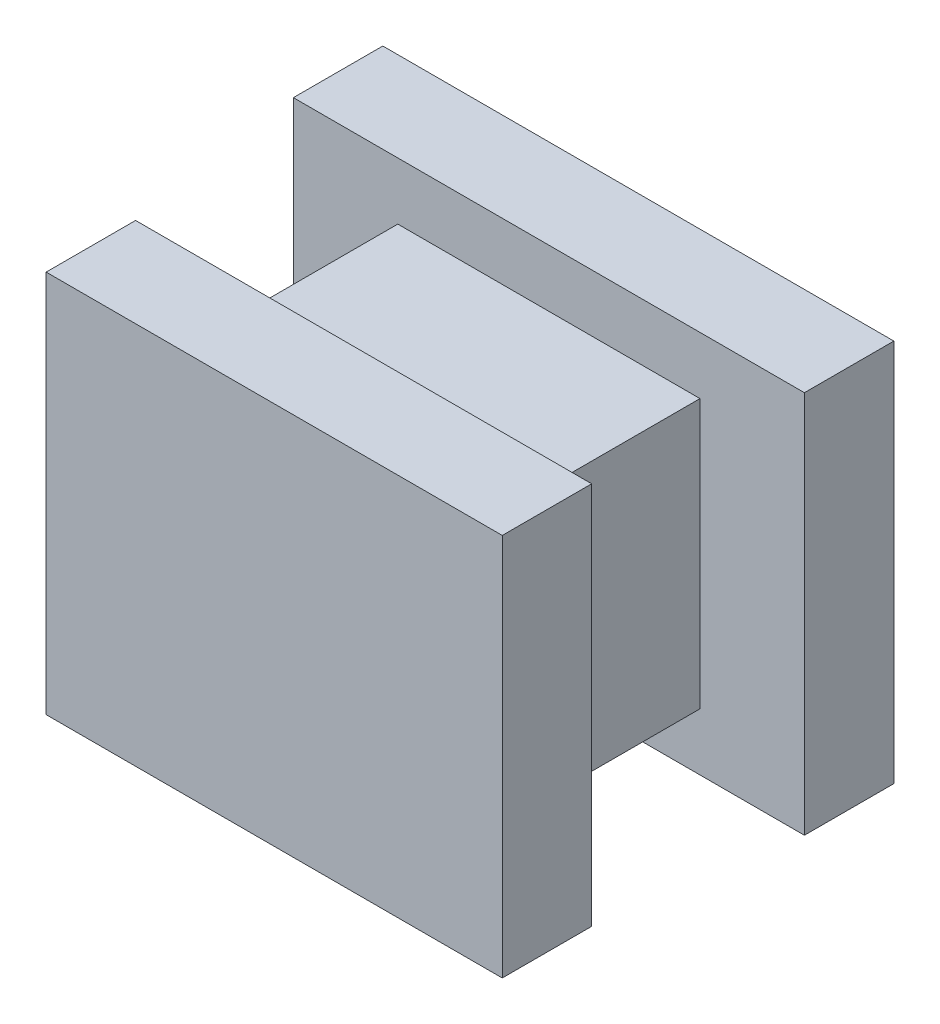
ISO-10303-21;
HEADER;
FILE_DESCRIPTION(('STEP AP214'),'2;1');
FILE_NAME('part.step','',(''),(''),'','','');
FILE_SCHEMA(('AUTOMOTIVE_DESIGN { 1 0 10303 214 1 1 1 1 }'));
ENDSEC;
DATA;
#1=APPLICATION_CONTEXT('core data for automotive mechanical design processes');
#2=APPLICATION_PROTOCOL_DEFINITION('international standard','automotive_design',2000,#1);
#3=PRODUCT_CONTEXT('',#1,'mechanical');
#4=PRODUCT('Part','Part','',(#3));
#5=PRODUCT_RELATED_PRODUCT_CATEGORY('part','',(#4));
#6=PRODUCT_DEFINITION_FORMATION('','',#4);
#7=PRODUCT_DEFINITION_CONTEXT('part definition',#1,'design');
#8=PRODUCT_DEFINITION('design','',#6,#7);
#9=PRODUCT_DEFINITION_SHAPE('','',#8);
#10=(LENGTH_UNIT() NAMED_UNIT(*) SI_UNIT(.MILLI.,.METRE.));
#11=(NAMED_UNIT(*) PLANE_ANGLE_UNIT() SI_UNIT($,.RADIAN.));
#12=(NAMED_UNIT(*) SI_UNIT($,.STERADIAN.) SOLID_ANGLE_UNIT());
#13=UNCERTAINTY_MEASURE_WITH_UNIT(LENGTH_MEASURE(1.E-05),#10,'distance_accuracy_value','');
#14=(GEOMETRIC_REPRESENTATION_CONTEXT(3) GLOBAL_UNCERTAINTY_ASSIGNED_CONTEXT((#13)) GLOBAL_UNIT_ASSIGNED_CONTEXT((#10,
#11,#12)) REPRESENTATION_CONTEXT('',''));
#15=CARTESIAN_POINT('',(0.,0.,0.));
#16=DIRECTION('',(0.,0.,1.));
#17=DIRECTION('',(1.,0.,0.));
#18=AXIS2_PLACEMENT_3D('',#15,#16,#17);
#19=CARTESIAN_POINT('',(0.,0.,2.15));
#20=DIRECTION('',(0.,0.,-1.));
#21=DIRECTION('',(-1.,0.,0.));
#22=AXIS2_PLACEMENT_3D('',#19,#20,#21);
#23=PLANE('',#22);
#24=DIRECTION('',(1.,0.,0.));
#25=VECTOR('',#24,1.);
#26=CARTESIAN_POINT('',(-0.982734697956289,-0.851456943735229,2.15));
#27=LINE('',#26,#25);
#28=CARTESIAN_POINT('',(-0.982734697956289,-0.851456943735229,2.15));
#29=VERTEX_POINT('',#28);
#30=CARTESIAN_POINT('',(0.982734697956289,-0.851456943735229,2.15));
#31=VERTEX_POINT('',#30);
#32=EDGE_CURVE('E135',#29,#31,#27,.T.);
#33=ORIENTED_EDGE('',*,*,#32,.F.);
#34=DIRECTION('',(0.,-1.,0.));
#35=VECTOR('',#34,1.);
#36=CARTESIAN_POINT('',(-0.982734697956289,0.851456943735229,2.15));
#37=LINE('',#36,#35);
#38=CARTESIAN_POINT('',(-0.982734697956289,0.851456943735229,2.15));
#39=VERTEX_POINT('',#38);
#40=EDGE_CURVE('E119',#39,#29,#37,.T.);
#41=ORIENTED_EDGE('',*,*,#40,.F.);
#42=DIRECTION('',(-1.,0.,0.));
#43=VECTOR('',#42,1.);
#44=CARTESIAN_POINT('',(-0.982734697956289,0.851456943735229,2.15));
#45=LINE('',#44,#43);
#46=CARTESIAN_POINT('',(0.982734697956289,0.851456943735229,2.15));
#47=VERTEX_POINT('',#46);
#48=EDGE_CURVE('E112',#47,#39,#45,.T.);
#49=ORIENTED_EDGE('',*,*,#48,.F.);
#50=DIRECTION('',(0.,1.,0.));
#51=VECTOR('',#50,1.);
#52=CARTESIAN_POINT('',(0.982734697956289,0.851456943735229,2.15));
#53=LINE('',#52,#51);
#54=EDGE_CURVE('E117',#31,#47,#53,.T.);
#55=ORIENTED_EDGE('',*,*,#54,.F.);
#56=EDGE_LOOP('',(#33,#41,#49,#55));
#57=FACE_BOUND('',#56,.T.);
#58=DIRECTION('',(1.,0.,0.));
#59=VECTOR('',#58,1.);
#60=CARTESIAN_POINT('',(-1.18273469795629,1.05145694373523,2.15));
#61=LINE('',#60,#59);
#62=CARTESIAN_POINT('',(-1.18273469795629,1.05145694373523,2.15));
#63=VERTEX_POINT('',#62);
#64=CARTESIAN_POINT('',(1.18273469795629,1.05145694373523,2.15));
#65=VERTEX_POINT('',#64);
#66=EDGE_CURVE('E167',#63,#65,#61,.T.);
#67=ORIENTED_EDGE('',*,*,#66,.F.);
#68=DIRECTION('',(0.,1.,0.));
#69=VECTOR('',#68,1.);
#70=CARTESIAN_POINT('',(-1.18273469795629,-1.05145694373523,2.15));
#71=LINE('',#70,#69);
#72=CARTESIAN_POINT('',(-1.18273469795629,-1.05145694373523,2.15));
#73=VERTEX_POINT('',#72);
#74=EDGE_CURVE('E159',#73,#63,#71,.T.);
#75=ORIENTED_EDGE('',*,*,#74,.F.);
#76=DIRECTION('',(-1.,0.,0.));
#77=VECTOR('',#76,1.);
#78=CARTESIAN_POINT('',(-1.18273469795629,-1.05145694373523,2.15));
#79=LINE('',#78,#77);
#80=CARTESIAN_POINT('',(1.18273469795629,-1.05145694373523,2.15));
#81=VERTEX_POINT('',#80);
#82=EDGE_CURVE('E156',#81,#73,#79,.T.);
#83=ORIENTED_EDGE('',*,*,#82,.F.);
#84=DIRECTION('',(0.,-1.,0.));
#85=VECTOR('',#84,1.);
#86=CARTESIAN_POINT('',(1.18273469795629,-1.05145694373523,2.15));
#87=LINE('',#86,#85);
#88=EDGE_CURVE('E123',#65,#81,#87,.T.);
#89=ORIENTED_EDGE('',*,*,#88,.F.);
#90=EDGE_LOOP('',(#67,#75,#83,#89));
#91=FACE_BOUND('',#90,.T.);
#92=ADVANCED_FACE('F43',(#57,#91),#23,.F.);
#93=CARTESIAN_POINT('',(-0.982734697956289,0.851456943735229,2.15));
#94=DIRECTION('',(0.,-1.,0.));
#95=DIRECTION('',(0.,0.,-1.));
#96=AXIS2_PLACEMENT_3D('',#93,#94,#95);
#97=PLANE('',#96);
#98=DIRECTION('',(-1.,0.,0.));
#99=VECTOR('',#98,1.);
#100=CARTESIAN_POINT('',(-0.982734697956289,0.851456943735229,0.7));
#101=LINE('',#100,#99);
#102=CARTESIAN_POINT('',(0.982734697956289,0.851456943735229,0.7));
#103=VERTEX_POINT('',#102);
#104=CARTESIAN_POINT('',(-0.982734697956289,0.851456943735229,0.7));
#105=VERTEX_POINT('',#104);
#106=EDGE_CURVE('E128',#103,#105,#101,.T.);
#107=ORIENTED_EDGE('',*,*,#106,.F.);
#108=DIRECTION('',(0.,0.,-1.));
#109=VECTOR('',#108,1.);
#110=CARTESIAN_POINT('',(0.982734697956289,0.851456943735229,2.15));
#111=LINE('',#110,#109);
#112=EDGE_CURVE('E47',#47,#103,#111,.T.);
#113=ORIENTED_EDGE('',*,*,#112,.F.);
#114=ORIENTED_EDGE('',*,*,#48,.T.);
#115=DIRECTION('',(0.,0.,-1.));
#116=VECTOR('',#115,1.);
#117=CARTESIAN_POINT('',(-0.982734697956289,0.851456943735229,2.15));
#118=LINE('',#117,#116);
#119=EDGE_CURVE('E124',#39,#105,#118,.T.);
#120=ORIENTED_EDGE('',*,*,#119,.T.);
#121=EDGE_LOOP('',(#107,#113,#114,#120));
#122=FACE_BOUND('',#121,.T.);
#123=ADVANCED_FACE('F127',(#122),#97,.T.);
#124=CARTESIAN_POINT('',(-0.982734697956289,0.851456943735229,2.15));
#125=DIRECTION('',(1.,0.,0.));
#126=DIRECTION('',(0.,0.,-1.));
#127=AXIS2_PLACEMENT_3D('',#124,#125,#126);
#128=PLANE('',#127);
#129=DIRECTION('',(0.,-1.,0.));
#130=VECTOR('',#129,1.);
#131=CARTESIAN_POINT('',(-0.982734697956289,0.851456943735229,0.7));
#132=LINE('',#131,#130);
#133=CARTESIAN_POINT('',(-0.982734697956289,-0.851456943735229,0.7));
#134=VERTEX_POINT('',#133);
#135=EDGE_CURVE('E163',#105,#134,#132,.T.);
#136=ORIENTED_EDGE('',*,*,#135,.F.);
#137=ORIENTED_EDGE('',*,*,#119,.F.);
#138=ORIENTED_EDGE('',*,*,#40,.T.);
#139=DIRECTION('',(0.,0.,-1.));
#140=VECTOR('',#139,1.);
#141=CARTESIAN_POINT('',(-0.982734697956289,-0.851456943735229,2.15));
#142=LINE('',#141,#140);
#143=EDGE_CURVE('E139',#29,#134,#142,.T.);
#144=ORIENTED_EDGE('',*,*,#143,.T.);
#145=EDGE_LOOP('',(#136,#137,#138,#144));
#146=FACE_BOUND('',#145,.T.);
#147=ADVANCED_FACE('F200',(#146),#128,.T.);
#148=CARTESIAN_POINT('',(-0.982734697956289,-0.851456943735229,2.15));
#149=DIRECTION('',(0.,1.,0.));
#150=DIRECTION('',(0.,0.,1.));
#151=AXIS2_PLACEMENT_3D('',#148,#149,#150);
#152=PLANE('',#151);
#153=DIRECTION('',(1.,0.,0.));
#154=VECTOR('',#153,1.);
#155=CARTESIAN_POINT('',(-0.982734697956289,-0.851456943735229,0.7));
#156=LINE('',#155,#154);
#157=CARTESIAN_POINT('',(0.982734697956289,-0.851456943735229,0.7));
#158=VERTEX_POINT('',#157);
#159=EDGE_CURVE('E161',#134,#158,#156,.T.);
#160=ORIENTED_EDGE('',*,*,#159,.F.);
#161=ORIENTED_EDGE('',*,*,#143,.F.);
#162=ORIENTED_EDGE('',*,*,#32,.T.);
#163=DIRECTION('',(0.,0.,-1.));
#164=VECTOR('',#163,1.);
#165=CARTESIAN_POINT('',(0.982734697956289,-0.851456943735229,2.15));
#166=LINE('',#165,#164);
#167=EDGE_CURVE('E134',#31,#158,#166,.T.);
#168=ORIENTED_EDGE('',*,*,#167,.T.);
#169=EDGE_LOOP('',(#160,#161,#162,#168));
#170=FACE_BOUND('',#169,.T.);
#171=ADVANCED_FACE('F193',(#170),#152,.T.);
#172=CARTESIAN_POINT('',(0.982734697956289,0.851456943735229,2.15));
#173=DIRECTION('',(-1.,0.,0.));
#174=DIRECTION('',(0.,0.,1.));
#175=AXIS2_PLACEMENT_3D('',#172,#173,#174);
#176=PLANE('',#175);
#177=DIRECTION('',(0.,1.,0.));
#178=VECTOR('',#177,1.);
#179=CARTESIAN_POINT('',(0.982734697956289,0.851456943735229,0.7));
#180=LINE('',#179,#178);
#181=EDGE_CURVE('E158',#158,#103,#180,.T.);
#182=ORIENTED_EDGE('',*,*,#181,.F.);
#183=ORIENTED_EDGE('',*,*,#167,.F.);
#184=ORIENTED_EDGE('',*,*,#54,.T.);
#185=ORIENTED_EDGE('',*,*,#112,.T.);
#186=EDGE_LOOP('',(#182,#183,#184,#185));
#187=FACE_BOUND('',#186,.T.);
#188=ADVANCED_FACE('F132',(#187),#176,.T.);
#189=CARTESIAN_POINT('',(0.,0.,0.7));
#190=DIRECTION('',(0.,0.,-1.));
#191=DIRECTION('',(-1.,0.,0.));
#192=AXIS2_PLACEMENT_3D('',#189,#190,#191);
#193=PLANE('',#192);
#194=DIRECTION('',(0.,1.,0.));
#195=VECTOR('',#194,1.);
#196=CARTESIAN_POINT('',(1.18273469795629,-1.05145694373523,0.7));
#197=LINE('',#196,#195);
#198=CARTESIAN_POINT('',(1.18273469795629,-1.05145694373523,0.7));
#199=VERTEX_POINT('',#198);
#200=CARTESIAN_POINT('',(1.18273469795629,1.05145694373523,0.7));
#201=VERTEX_POINT('',#200);
#202=EDGE_CURVE('E12',#199,#201,#197,.T.);
#203=ORIENTED_EDGE('',*,*,#202,.F.);
#204=DIRECTION('',(1.,0.,0.));
#205=VECTOR('',#204,1.);
#206=CARTESIAN_POINT('',(-1.18273469795629,-1.05145694373523,0.7));
#207=LINE('',#206,#205);
#208=CARTESIAN_POINT('',(-1.18273469795629,-1.05145694373523,0.7));
#209=VERTEX_POINT('',#208);
#210=EDGE_CURVE('E146',#209,#199,#207,.T.);
#211=ORIENTED_EDGE('',*,*,#210,.F.);
#212=DIRECTION('',(0.,-1.,0.));
#213=VECTOR('',#212,1.);
#214=CARTESIAN_POINT('',(-1.18273469795629,-1.05145694373523,0.7));
#215=LINE('',#214,#213);
#216=CARTESIAN_POINT('',(-1.18273469795629,1.05145694373523,0.7));
#217=VERTEX_POINT('',#216);
#218=EDGE_CURVE('E152',#217,#209,#215,.T.);
#219=ORIENTED_EDGE('',*,*,#218,.F.);
#220=DIRECTION('',(-1.,0.,0.));
#221=VECTOR('',#220,1.);
#222=CARTESIAN_POINT('',(-1.18273469795629,1.05145694373523,0.7));
#223=LINE('',#222,#221);
#224=EDGE_CURVE('E52',#201,#217,#223,.T.);
#225=ORIENTED_EDGE('',*,*,#224,.F.);
#226=EDGE_LOOP('',(#203,#211,#219,#225));
#227=FACE_BOUND('',#226,.T.);
#228=ORIENTED_EDGE('',*,*,#159,.T.);
#229=ORIENTED_EDGE('',*,*,#181,.T.);
#230=ORIENTED_EDGE('',*,*,#106,.T.);
#231=ORIENTED_EDGE('',*,*,#135,.T.);
#232=EDGE_LOOP('',(#228,#229,#230,#231));
#233=FACE_BOUND('',#232,.T.);
#234=ADVANCED_FACE('F45',(#227,#233),#193,.T.);
#235=CARTESIAN_POINT('',(-1.18273469795629,-1.05145694373523,2.852));
#236=DIRECTION('',(0.,1.,0.));
#237=DIRECTION('',(0.,0.,1.));
#238=AXIS2_PLACEMENT_3D('',#235,#236,#237);
#239=PLANE('',#238);
#240=DIRECTION('',(0.,0.,-1.));
#241=VECTOR('',#240,1.);
#242=CARTESIAN_POINT('',(1.18273469795629,-1.05145694373523,2.852));
#243=LINE('',#242,#241);
#244=EDGE_CURVE('E144',#81,#199,#243,.T.);
#245=ORIENTED_EDGE('',*,*,#244,.F.);
#246=ORIENTED_EDGE('',*,*,#82,.T.);
#247=DIRECTION('',(0.,0.,-1.));
#248=VECTOR('',#247,1.);
#249=CARTESIAN_POINT('',(-1.18273469795629,-1.05145694373523,2.852));
#250=LINE('',#249,#248);
#251=EDGE_CURVE('E147',#73,#209,#250,.T.);
#252=ORIENTED_EDGE('',*,*,#251,.T.);
#253=ORIENTED_EDGE('',*,*,#210,.T.);
#254=EDGE_LOOP('',(#245,#246,#252,#253));
#255=FACE_BOUND('',#254,.T.);
#256=ADVANCED_FACE('F177',(#255),#239,.F.);
#257=CARTESIAN_POINT('',(1.18273469795629,-1.05145694373523,2.852));
#258=DIRECTION('',(-1.,0.,0.));
#259=DIRECTION('',(0.,0.,1.));
#260=AXIS2_PLACEMENT_3D('',#257,#258,#259);
#261=PLANE('',#260);
#262=DIRECTION('',(0.,0.,-1.));
#263=VECTOR('',#262,1.);
#264=CARTESIAN_POINT('',(1.18273469795629,1.05145694373523,2.852));
#265=LINE('',#264,#263);
#266=EDGE_CURVE('E67',#65,#201,#265,.T.);
#267=ORIENTED_EDGE('',*,*,#266,.F.);
#268=ORIENTED_EDGE('',*,*,#88,.T.);
#269=ORIENTED_EDGE('',*,*,#244,.T.);
#270=ORIENTED_EDGE('',*,*,#202,.T.);
#271=EDGE_LOOP('',(#267,#268,#269,#270));
#272=FACE_BOUND('',#271,.T.);
#273=ADVANCED_FACE('F171',(#272),#261,.F.);
#274=CARTESIAN_POINT('',(-1.18273469795629,-1.05145694373523,2.852));
#275=DIRECTION('',(1.,0.,0.));
#276=DIRECTION('',(0.,0.,-1.));
#277=AXIS2_PLACEMENT_3D('',#274,#275,#276);
#278=PLANE('',#277);
#279=ORIENTED_EDGE('',*,*,#251,.F.);
#280=ORIENTED_EDGE('',*,*,#74,.T.);
#281=DIRECTION('',(0.,0.,-1.));
#282=VECTOR('',#281,1.);
#283=CARTESIAN_POINT('',(-1.18273469795629,1.05145694373523,2.852));
#284=LINE('',#283,#282);
#285=EDGE_CURVE('E60',#63,#217,#284,.T.);
#286=ORIENTED_EDGE('',*,*,#285,.T.);
#287=ORIENTED_EDGE('',*,*,#218,.T.);
#288=EDGE_LOOP('',(#279,#280,#286,#287));
#289=FACE_BOUND('',#288,.T.);
#290=ADVANCED_FACE('F185',(#289),#278,.F.);
#291=CARTESIAN_POINT('',(-1.18273469795629,1.05145694373523,2.852));
#292=DIRECTION('',(0.,-1.,0.));
#293=DIRECTION('',(0.,0.,-1.));
#294=AXIS2_PLACEMENT_3D('',#291,#292,#293);
#295=PLANE('',#294);
#296=ORIENTED_EDGE('',*,*,#285,.F.);
#297=ORIENTED_EDGE('',*,*,#66,.T.);
#298=ORIENTED_EDGE('',*,*,#266,.T.);
#299=ORIENTED_EDGE('',*,*,#224,.T.);
#300=EDGE_LOOP('',(#296,#297,#298,#299));
#301=FACE_BOUND('',#300,.T.);
#302=ADVANCED_FACE('F183',(#301),#295,.F.);
#303=CLOSED_SHELL('',(#92,#123,#147,#171,#188,#234,#256,#273,#290,#302));
#304=MANIFOLD_SOLID_BREP('B2',#303);
#305=CARTESIAN_POINT('',(2.,1.5,0.7));
#306=DIRECTION('',(-1.,0.,0.));
#307=DIRECTION('',(0.,0.,1.));
#308=AXIS2_PLACEMENT_3D('',#305,#306,#307);
#309=PLANE('',#308);
#310=DIRECTION('',(0.,1.,0.));
#311=VECTOR('',#310,1.);
#312=CARTESIAN_POINT('',(2.,1.5,0.));
#313=LINE('',#312,#311);
#314=CARTESIAN_POINT('',(2.,-1.5,0.));
#315=VERTEX_POINT('',#314);
#316=CARTESIAN_POINT('',(2.,1.5,0.));
#317=VERTEX_POINT('',#316);
#318=EDGE_CURVE('E431',#315,#317,#313,.T.);
#319=ORIENTED_EDGE('',*,*,#318,.T.);
#320=DIRECTION('',(0.,0.,-1.));
#321=VECTOR('',#320,1.);
#322=CARTESIAN_POINT('',(2.,1.5,0.7));
#323=LINE('',#322,#321);
#324=CARTESIAN_POINT('',(2.,1.5,0.7));
#325=VERTEX_POINT('',#324);
#326=EDGE_CURVE('E41',#325,#317,#323,.T.);
#327=ORIENTED_EDGE('',*,*,#326,.F.);
#328=DIRECTION('',(0.,1.,0.));
#329=VECTOR('',#328,1.);
#330=CARTESIAN_POINT('',(2.,1.5,0.7));
#331=LINE('',#330,#329);
#332=CARTESIAN_POINT('',(2.,-1.5,0.7));
#333=VERTEX_POINT('',#332);
#334=EDGE_CURVE('E432',#333,#325,#331,.T.);
#335=ORIENTED_EDGE('',*,*,#334,.F.);
#336=DIRECTION('',(0.,0.,-1.));
#337=VECTOR('',#336,1.);
#338=CARTESIAN_POINT('',(2.,-1.5,0.7));
#339=LINE('',#338,#337);
#340=EDGE_CURVE('E442',#333,#315,#339,.T.);
#341=ORIENTED_EDGE('',*,*,#340,.T.);
#342=EDGE_LOOP('',(#319,#327,#335,#341));
#343=FACE_BOUND('',#342,.T.);
#344=ADVANCED_FACE('F273',(#343),#309,.F.);
#345=CARTESIAN_POINT('',(-2.,1.5,0.7));
#346=DIRECTION('',(0.,-1.,0.));
#347=DIRECTION('',(0.,0.,-1.));
#348=AXIS2_PLACEMENT_3D('',#345,#346,#347);
#349=PLANE('',#348);
#350=DIRECTION('',(-1.,0.,0.));
#351=VECTOR('',#350,1.);
#352=CARTESIAN_POINT('',(-2.,1.5,0.));
#353=LINE('',#352,#351);
#354=CARTESIAN_POINT('',(-2.,1.5,0.));
#355=VERTEX_POINT('',#354);
#356=EDGE_CURVE('E445',#317,#355,#353,.T.);
#357=ORIENTED_EDGE('',*,*,#356,.T.);
#358=DIRECTION('',(0.,0.,-1.));
#359=VECTOR('',#358,1.);
#360=CARTESIAN_POINT('',(-2.,1.5,0.7));
#361=LINE('',#360,#359);
#362=CARTESIAN_POINT('',(-2.,1.5,0.7));
#363=VERTEX_POINT('',#362);
#364=EDGE_CURVE('E280',#363,#355,#361,.T.);
#365=ORIENTED_EDGE('',*,*,#364,.F.);
#366=DIRECTION('',(-1.,0.,0.));
#367=VECTOR('',#366,1.);
#368=CARTESIAN_POINT('',(-2.,1.5,0.7));
#369=LINE('',#368,#367);
#370=EDGE_CURVE('E435',#325,#363,#369,.T.);
#371=ORIENTED_EDGE('',*,*,#370,.F.);
#372=ORIENTED_EDGE('',*,*,#326,.T.);
#373=EDGE_LOOP('',(#357,#365,#371,#372));
#374=FACE_BOUND('',#373,.T.);
#375=ADVANCED_FACE('F475',(#374),#349,.F.);
#376=CARTESIAN_POINT('',(-2.,1.5,0.7));
#377=DIRECTION('',(1.,0.,0.));
#378=DIRECTION('',(0.,0.,-1.));
#379=AXIS2_PLACEMENT_3D('',#376,#377,#378);
#380=PLANE('',#379);
#381=DIRECTION('',(0.,-1.,0.));
#382=VECTOR('',#381,1.);
#383=CARTESIAN_POINT('',(-2.,1.5,0.));
#384=LINE('',#383,#382);
#385=CARTESIAN_POINT('',(-2.,-1.5,0.));
#386=VERTEX_POINT('',#385);
#387=EDGE_CURVE('E447',#355,#386,#384,.T.);
#388=ORIENTED_EDGE('',*,*,#387,.T.);
#389=DIRECTION('',(0.,0.,-1.));
#390=VECTOR('',#389,1.);
#391=CARTESIAN_POINT('',(-2.,-1.5,0.7));
#392=LINE('',#391,#390);
#393=CARTESIAN_POINT('',(-2.,-1.5,0.7));
#394=VERTEX_POINT('',#393);
#395=EDGE_CURVE('E452',#394,#386,#392,.T.);
#396=ORIENTED_EDGE('',*,*,#395,.F.);
#397=DIRECTION('',(0.,-1.,0.));
#398=VECTOR('',#397,1.);
#399=CARTESIAN_POINT('',(-2.,1.5,0.7));
#400=LINE('',#399,#398);
#401=EDGE_CURVE('E438',#363,#394,#400,.T.);
#402=ORIENTED_EDGE('',*,*,#401,.F.);
#403=ORIENTED_EDGE('',*,*,#364,.T.);
#404=EDGE_LOOP('',(#388,#396,#402,#403));
#405=FACE_BOUND('',#404,.T.);
#406=ADVANCED_FACE('F459',(#405),#380,.F.);
#407=CARTESIAN_POINT('',(-2.,-1.5,0.7));
#408=DIRECTION('',(0.,1.,0.));
#409=DIRECTION('',(0.,0.,1.));
#410=AXIS2_PLACEMENT_3D('',#407,#408,#409);
#411=PLANE('',#410);
#412=DIRECTION('',(1.,0.,0.));
#413=VECTOR('',#412,1.);
#414=CARTESIAN_POINT('',(-2.,-1.5,0.));
#415=LINE('',#414,#413);
#416=EDGE_CURVE('E436',#386,#315,#415,.T.);
#417=ORIENTED_EDGE('',*,*,#416,.T.);
#418=ORIENTED_EDGE('',*,*,#340,.F.);
#419=DIRECTION('',(1.,0.,0.));
#420=VECTOR('',#419,1.);
#421=CARTESIAN_POINT('',(-2.,-1.5,0.7));
#422=LINE('',#421,#420);
#423=EDGE_CURVE('E440',#394,#333,#422,.T.);
#424=ORIENTED_EDGE('',*,*,#423,.F.);
#425=ORIENTED_EDGE('',*,*,#395,.T.);
#426=EDGE_LOOP('',(#417,#418,#424,#425));
#427=FACE_BOUND('',#426,.T.);
#428=ADVANCED_FACE('F468',(#427),#411,.F.);
#429=CARTESIAN_POINT('',(0.,0.,0.7));
#430=DIRECTION('',(0.,0.,1.));
#431=DIRECTION('',(1.,0.,0.));
#432=AXIS2_PLACEMENT_3D('',#429,#430,#431);
#433=PLANE('',#432);
#434=DIRECTION('',(0.,1.,0.));
#435=VECTOR('',#434,1.);
#436=CARTESIAN_POINT('',(0.982734697956289,0.851456943735229,0.7));
#437=LINE('',#436,#435);
#438=CARTESIAN_POINT('',(0.982734697956289,-0.851456943735229,0.7));
#439=VERTEX_POINT('',#438);
#440=CARTESIAN_POINT('',(0.982734697956289,0.851456943735229,0.7));
#441=VERTEX_POINT('',#440);
#442=EDGE_CURVE('E287',#439,#441,#437,.T.);
#443=ORIENTED_EDGE('',*,*,#442,.F.);
#444=DIRECTION('',(1.,0.,0.));
#445=VECTOR('',#444,1.);
#446=CARTESIAN_POINT('',(-0.982734697956289,-0.851456943735229,0.7));
#447=LINE('',#446,#445);
#448=CARTESIAN_POINT('',(-0.982734697956289,-0.851456943735229,0.7));
#449=VERTEX_POINT('',#448);
#450=EDGE_CURVE('E291',#449,#439,#447,.T.);
#451=ORIENTED_EDGE('',*,*,#450,.F.);
#452=DIRECTION('',(0.,-1.,0.));
#453=VECTOR('',#452,1.);
#454=CARTESIAN_POINT('',(-0.982734697956289,0.851456943735229,0.7));
#455=LINE('',#454,#453);
#456=CARTESIAN_POINT('',(-0.982734697956289,0.851456943735229,0.7));
#457=VERTEX_POINT('',#456);
#458=EDGE_CURVE('E417',#457,#449,#455,.T.);
#459=ORIENTED_EDGE('',*,*,#458,.F.);
#460=DIRECTION('',(-1.,0.,0.));
#461=VECTOR('',#460,1.);
#462=CARTESIAN_POINT('',(-0.982734697956289,0.851456943735229,0.7));
#463=LINE('',#462,#461);
#464=EDGE_CURVE('E414',#441,#457,#463,.T.);
#465=ORIENTED_EDGE('',*,*,#464,.F.);
#466=EDGE_LOOP('',(#443,#451,#459,#465));
#467=FACE_BOUND('',#466,.T.);
#468=ORIENTED_EDGE('',*,*,#334,.T.);
#469=ORIENTED_EDGE('',*,*,#370,.T.);
#470=ORIENTED_EDGE('',*,*,#401,.T.);
#471=ORIENTED_EDGE('',*,*,#423,.T.);
#472=EDGE_LOOP('',(#468,#469,#470,#471));
#473=FACE_BOUND('',#472,.T.);
#474=ADVANCED_FACE('F474',(#467,#473),#433,.T.);
#475=CARTESIAN_POINT('',(0.,0.,0.));
#476=DIRECTION('',(0.,0.,1.));
#477=DIRECTION('',(1.,0.,0.));
#478=AXIS2_PLACEMENT_3D('',#475,#476,#477);
#479=PLANE('',#478);
#480=ORIENTED_EDGE('',*,*,#318,.F.);
#481=ORIENTED_EDGE('',*,*,#416,.F.);
#482=ORIENTED_EDGE('',*,*,#387,.F.);
#483=ORIENTED_EDGE('',*,*,#356,.F.);
#484=EDGE_LOOP('',(#480,#481,#482,#483));
#485=FACE_BOUND('',#484,.T.);
#486=ADVANCED_FACE('F465',(#485),#479,.F.);
#487=CARTESIAN_POINT('',(0.982734697956289,0.851456943735229,2.15));
#488=DIRECTION('',(-1.,0.,0.));
#489=DIRECTION('',(0.,0.,1.));
#490=AXIS2_PLACEMENT_3D('',#487,#488,#489);
#491=PLANE('',#490);
#492=ORIENTED_EDGE('',*,*,#442,.T.);
#493=DIRECTION('',(0.,0.,-1.));
#494=VECTOR('',#493,1.);
#495=CARTESIAN_POINT('',(0.982734697956289,0.851456943735229,2.15));
#496=LINE('',#495,#494);
#497=CARTESIAN_POINT('',(0.982734697956289,0.851456943735229,2.15));
#498=VERTEX_POINT('',#497);
#499=EDGE_CURVE('E428',#498,#441,#496,.T.);
#500=ORIENTED_EDGE('',*,*,#499,.F.);
#501=DIRECTION('',(0.,1.,0.));
#502=VECTOR('',#501,1.);
#503=CARTESIAN_POINT('',(0.982734697956289,0.851456943735229,2.15));
#504=LINE('',#503,#502);
#505=CARTESIAN_POINT('',(0.982734697956289,-0.851456943735229,2.15));
#506=VERTEX_POINT('',#505);
#507=EDGE_CURVE('E400',#506,#498,#504,.T.);
#508=ORIENTED_EDGE('',*,*,#507,.F.);
#509=DIRECTION('',(0.,0.,-1.));
#510=VECTOR('',#509,1.);
#511=CARTESIAN_POINT('',(0.982734697956289,-0.851456943735229,2.15));
#512=LINE('',#511,#510);
#513=EDGE_CURVE('E412',#506,#439,#512,.T.);
#514=ORIENTED_EDGE('',*,*,#513,.T.);
#515=EDGE_LOOP('',(#492,#500,#508,#514));
#516=FACE_BOUND('',#515,.T.);
#517=ADVANCED_FACE('F487',(#516),#491,.F.);
#518=CARTESIAN_POINT('',(-0.982734697956289,0.851456943735229,2.15));
#519=DIRECTION('',(0.,-1.,0.));
#520=DIRECTION('',(0.,0.,-1.));
#521=AXIS2_PLACEMENT_3D('',#518,#519,#520);
#522=PLANE('',#521);
#523=ORIENTED_EDGE('',*,*,#464,.T.);
#524=DIRECTION('',(0.,0.,-1.));
#525=VECTOR('',#524,1.);
#526=CARTESIAN_POINT('',(-0.982734697956289,0.851456943735229,2.15));
#527=LINE('',#526,#525);
#528=CARTESIAN_POINT('',(-0.982734697956289,0.851456943735229,2.15));
#529=VERTEX_POINT('',#528);
#530=EDGE_CURVE('E425',#529,#457,#527,.T.);
#531=ORIENTED_EDGE('',*,*,#530,.F.);
#532=DIRECTION('',(-1.,0.,0.));
#533=VECTOR('',#532,1.);
#534=CARTESIAN_POINT('',(-0.982734697956289,0.851456943735229,2.15));
#535=LINE('',#534,#533);
#536=EDGE_CURVE('E403',#498,#529,#535,.T.);
#537=ORIENTED_EDGE('',*,*,#536,.F.);
#538=ORIENTED_EDGE('',*,*,#499,.T.);
#539=EDGE_LOOP('',(#523,#531,#537,#538));
#540=FACE_BOUND('',#539,.T.);
#541=ADVANCED_FACE('F492',(#540),#522,.F.);
#542=CARTESIAN_POINT('',(-0.982734697956289,0.851456943735229,2.15));
#543=DIRECTION('',(1.,0.,0.));
#544=DIRECTION('',(0.,0.,-1.));
#545=AXIS2_PLACEMENT_3D('',#542,#543,#544);
#546=PLANE('',#545);
#547=ORIENTED_EDGE('',*,*,#458,.T.);
#548=DIRECTION('',(0.,0.,-1.));
#549=VECTOR('',#548,1.);
#550=CARTESIAN_POINT('',(-0.982734697956289,-0.851456943735229,2.15));
#551=LINE('',#550,#549);
#552=CARTESIAN_POINT('',(-0.982734697956289,-0.851456943735229,2.15));
#553=VERTEX_POINT('',#552);
#554=EDGE_CURVE('E422',#553,#449,#551,.T.);
#555=ORIENTED_EDGE('',*,*,#554,.F.);
#556=DIRECTION('',(0.,-1.,0.));
#557=VECTOR('',#556,1.);
#558=CARTESIAN_POINT('',(-0.982734697956289,0.851456943735229,2.15));
#559=LINE('',#558,#557);
#560=EDGE_CURVE('E406',#529,#553,#559,.T.);
#561=ORIENTED_EDGE('',*,*,#560,.F.);
#562=ORIENTED_EDGE('',*,*,#530,.T.);
#563=EDGE_LOOP('',(#547,#555,#561,#562));
#564=FACE_BOUND('',#563,.T.);
#565=ADVANCED_FACE('F496',(#564),#546,.F.);
#566=CARTESIAN_POINT('',(-0.982734697956289,-0.851456943735229,2.15));
#567=DIRECTION('',(0.,1.,0.));
#568=DIRECTION('',(0.,0.,1.));
#569=AXIS2_PLACEMENT_3D('',#566,#567,#568);
#570=PLANE('',#569);
#571=ORIENTED_EDGE('',*,*,#450,.T.);
#572=ORIENTED_EDGE('',*,*,#513,.F.);
#573=DIRECTION('',(1.,0.,0.));
#574=VECTOR('',#573,1.);
#575=CARTESIAN_POINT('',(-0.982734697956289,-0.851456943735229,2.15));
#576=LINE('',#575,#574);
#577=EDGE_CURVE('E409',#553,#506,#576,.T.);
#578=ORIENTED_EDGE('',*,*,#577,.F.);
#579=ORIENTED_EDGE('',*,*,#554,.T.);
#580=EDGE_LOOP('',(#571,#572,#578,#579));
#581=FACE_BOUND('',#580,.T.);
#582=ADVANCED_FACE('F500',(#581),#570,.F.);
#583=CARTESIAN_POINT('',(-1.785,1.5,2.85));
#584=DIRECTION('',(0.,1.,0.));
#585=DIRECTION('',(0.,0.,1.));
#586=AXIS2_PLACEMENT_3D('',#583,#584,#585);
#587=PLANE('',#586);
#588=DIRECTION('',(1.,0.,0.));
#589=VECTOR('',#588,1.);
#590=CARTESIAN_POINT('',(-1.785,1.5,2.15));
#591=LINE('',#590,#589);
#592=CARTESIAN_POINT('',(-1.785,1.5,2.15));
#593=VERTEX_POINT('',#592);
#594=CARTESIAN_POINT('',(1.785,1.5,2.15));
#595=VERTEX_POINT('',#594);
#596=EDGE_CURVE('E390',#593,#595,#591,.T.);
#597=ORIENTED_EDGE('',*,*,#596,.F.);
#598=DIRECTION('',(0.,0.,-1.));
#599=VECTOR('',#598,1.);
#600=CARTESIAN_POINT('',(-1.785,1.5,2.85));
#601=LINE('',#600,#599);
#602=CARTESIAN_POINT('',(-1.785,1.5,2.85));
#603=VERTEX_POINT('',#602);
#604=EDGE_CURVE('E381',#603,#593,#601,.T.);
#605=ORIENTED_EDGE('',*,*,#604,.F.);
#606=DIRECTION('',(1.,0.,0.));
#607=VECTOR('',#606,1.);
#608=CARTESIAN_POINT('',(-1.785,1.5,2.85));
#609=LINE('',#608,#607);
#610=CARTESIAN_POINT('',(1.785,1.5,2.85));
#611=VERTEX_POINT('',#610);
#612=EDGE_CURVE('E375',#603,#611,#609,.T.);
#613=ORIENTED_EDGE('',*,*,#612,.T.);
#614=DIRECTION('',(0.,0.,-1.));
#615=VECTOR('',#614,1.);
#616=CARTESIAN_POINT('',(1.785,1.5,2.85));
#617=LINE('',#616,#615);
#618=EDGE_CURVE('E359',#611,#595,#617,.T.);
#619=ORIENTED_EDGE('',*,*,#618,.T.);
#620=EDGE_LOOP('',(#597,#605,#613,#619));
#621=FACE_BOUND('',#620,.T.);
#622=ADVANCED_FACE('F380',(#621),#587,.T.);
#623=CARTESIAN_POINT('',(-1.785,1.5,2.85));
#624=DIRECTION('',(1.,0.,0.));
#625=DIRECTION('',(0.,1.,0.));
#626=AXIS2_PLACEMENT_3D('',#623,#624,#625);
#627=PLANE('',#626);
#628=DIRECTION('',(0.,-1.,0.));
#629=VECTOR('',#628,1.);
#630=CARTESIAN_POINT('',(-1.785,1.5,2.15));
#631=LINE('',#630,#629);
#632=CARTESIAN_POINT('',(-1.785,-1.5,2.15));
#633=VERTEX_POINT('',#632);
#634=EDGE_CURVE('E383',#593,#633,#631,.T.);
#635=ORIENTED_EDGE('',*,*,#634,.T.);
#636=DIRECTION('',(0.,0.,-1.));
#637=VECTOR('',#636,1.);
#638=CARTESIAN_POINT('',(-1.785,-1.5,2.85));
#639=LINE('',#638,#637);
#640=CARTESIAN_POINT('',(-1.785,-1.5,2.85));
#641=VERTEX_POINT('',#640);
#642=EDGE_CURVE('E396',#641,#633,#639,.T.);
#643=ORIENTED_EDGE('',*,*,#642,.F.);
#644=DIRECTION('',(0.,-1.,0.));
#645=VECTOR('',#644,1.);
#646=CARTESIAN_POINT('',(-1.785,1.5,2.85));
#647=LINE('',#646,#645);
#648=EDGE_CURVE('E370',#603,#641,#647,.T.);
#649=ORIENTED_EDGE('',*,*,#648,.F.);
#650=ORIENTED_EDGE('',*,*,#604,.T.);
#651=EDGE_LOOP('',(#635,#643,#649,#650));
#652=FACE_BOUND('',#651,.T.);
#653=ADVANCED_FACE('F507',(#652),#627,.F.);
#654=CARTESIAN_POINT('',(-1.785,-1.5,2.85));
#655=DIRECTION('',(0.,1.,0.));
#656=DIRECTION('',(0.,0.,1.));
#657=AXIS2_PLACEMENT_3D('',#654,#655,#656);
#658=PLANE('',#657);
#659=DIRECTION('',(1.,0.,0.));
#660=VECTOR('',#659,1.);
#661=CARTESIAN_POINT('',(-1.785,-1.5,2.15));
#662=LINE('',#661,#660);
#663=CARTESIAN_POINT('',(1.785,-1.5,2.15));
#664=VERTEX_POINT('',#663);
#665=EDGE_CURVE('E385',#633,#664,#662,.T.);
#666=ORIENTED_EDGE('',*,*,#665,.T.);
#667=DIRECTION('',(0.,0.,-1.));
#668=VECTOR('',#667,1.);
#669=CARTESIAN_POINT('',(1.785,-1.5,2.85));
#670=LINE('',#669,#668);
#671=CARTESIAN_POINT('',(1.785,-1.5,2.85));
#672=VERTEX_POINT('',#671);
#673=EDGE_CURVE('E369',#672,#664,#670,.T.);
#674=ORIENTED_EDGE('',*,*,#673,.F.);
#675=DIRECTION('',(1.,0.,0.));
#676=VECTOR('',#675,1.);
#677=CARTESIAN_POINT('',(-1.785,-1.5,2.85));
#678=LINE('',#677,#676);
#679=EDGE_CURVE('E377',#641,#672,#678,.T.);
#680=ORIENTED_EDGE('',*,*,#679,.F.);
#681=ORIENTED_EDGE('',*,*,#642,.T.);
#682=EDGE_LOOP('',(#666,#674,#680,#681));
#683=FACE_BOUND('',#682,.T.);
#684=ADVANCED_FACE('F510',(#683),#658,.F.);
#685=CARTESIAN_POINT('',(1.785,1.5,2.85));
#686=DIRECTION('',(1.,0.,0.));
#687=DIRECTION('',(0.,1.,0.));
#688=AXIS2_PLACEMENT_3D('',#685,#686,#687);
#689=PLANE('',#688);
#690=DIRECTION('',(0.,-1.,0.));
#691=VECTOR('',#690,1.);
#692=CARTESIAN_POINT('',(1.785,1.5,2.15));
#693=LINE('',#692,#691);
#694=EDGE_CURVE('E364',#595,#664,#693,.T.);
#695=ORIENTED_EDGE('',*,*,#694,.F.);
#696=ORIENTED_EDGE('',*,*,#618,.F.);
#697=DIRECTION('',(0.,-1.,0.));
#698=VECTOR('',#697,1.);
#699=CARTESIAN_POINT('',(1.785,1.5,2.85));
#700=LINE('',#699,#698);
#701=EDGE_CURVE('E362',#611,#672,#700,.T.);
#702=ORIENTED_EDGE('',*,*,#701,.T.);
#703=ORIENTED_EDGE('',*,*,#673,.T.);
#704=EDGE_LOOP('',(#695,#696,#702,#703));
#705=FACE_BOUND('',#704,.T.);
#706=ADVANCED_FACE('F361',(#705),#689,.T.);
#707=CARTESIAN_POINT('',(0.,0.,2.85));
#708=DIRECTION('',(0.,0.,-1.));
#709=DIRECTION('',(-1.,0.,0.));
#710=AXIS2_PLACEMENT_3D('',#707,#708,#709);
#711=PLANE('',#710);
#712=ORIENTED_EDGE('',*,*,#612,.F.);
#713=ORIENTED_EDGE('',*,*,#648,.T.);
#714=ORIENTED_EDGE('',*,*,#679,.T.);
#715=ORIENTED_EDGE('',*,*,#701,.F.);
#716=EDGE_LOOP('',(#712,#713,#714,#715));
#717=FACE_BOUND('',#716,.T.);
#718=ADVANCED_FACE('F374',(#717),#711,.F.);
#719=CARTESIAN_POINT('',(0.,0.,2.15));
#720=DIRECTION('',(0.,0.,-1.));
#721=DIRECTION('',(-1.,0.,0.));
#722=AXIS2_PLACEMENT_3D('',#719,#720,#721);
#723=PLANE('',#722);
#724=ORIENTED_EDGE('',*,*,#577,.T.);
#725=ORIENTED_EDGE('',*,*,#507,.T.);
#726=ORIENTED_EDGE('',*,*,#536,.T.);
#727=ORIENTED_EDGE('',*,*,#560,.T.);
#728=EDGE_LOOP('',(#724,#725,#726,#727));
#729=FACE_BOUND('',#728,.T.);
#730=ORIENTED_EDGE('',*,*,#596,.T.);
#731=ORIENTED_EDGE('',*,*,#694,.T.);
#732=ORIENTED_EDGE('',*,*,#665,.F.);
#733=ORIENTED_EDGE('',*,*,#634,.F.);
#734=EDGE_LOOP('',(#730,#731,#732,#733));
#735=FACE_BOUND('',#734,.T.);
#736=ADVANCED_FACE('F517',(#729,#735),#723,.T.);
#737=CLOSED_SHELL('',(#344,#375,#406,#428,#474,#486,#517,#541,#565,#582,#622,#653,#684,#706,
#718,#736));
#738=MANIFOLD_SOLID_BREP('B6',#737);
#739=ADVANCED_BREP_SHAPE_REPRESENTATION('',(#18,#304,#738),#14);
#740=SHAPE_DEFINITION_REPRESENTATION(#9,#739);
ENDSEC;
END-ISO-10303-21;
